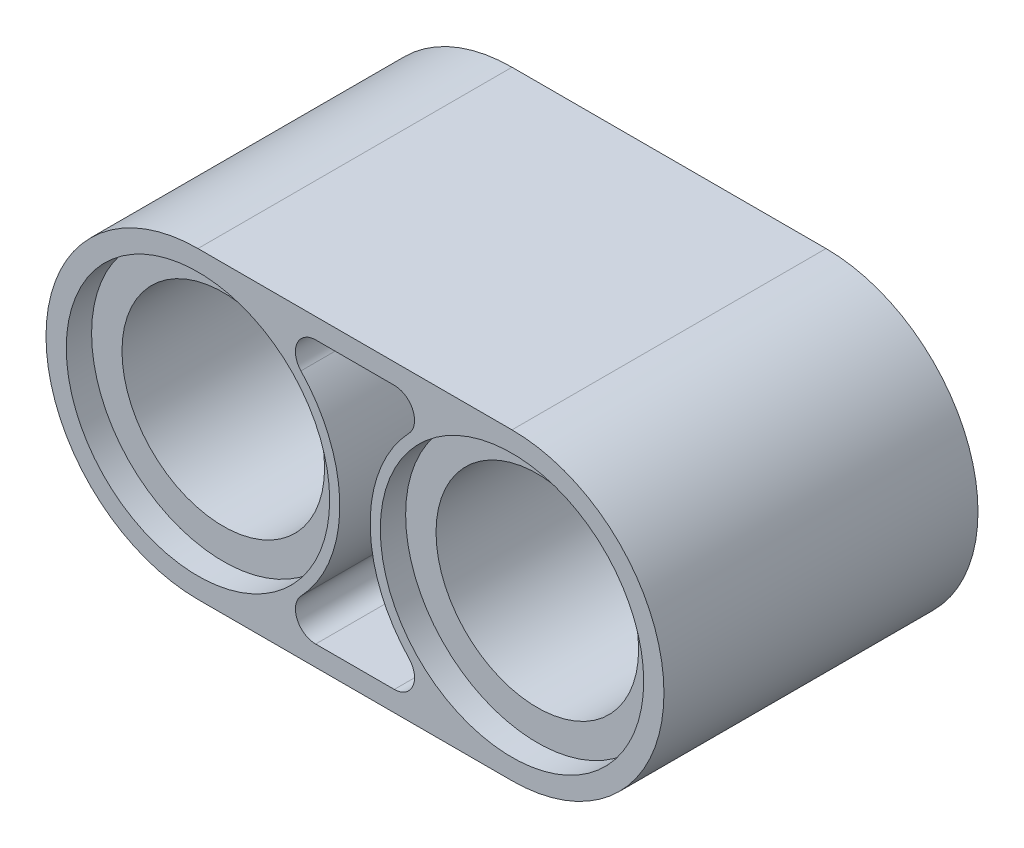
ISO-10303-21;
HEADER;
FILE_DESCRIPTION(('STEP AP214'),'2;1');
FILE_NAME('part.step','',(''),(''),'','','');
FILE_SCHEMA(('AUTOMOTIVE_DESIGN { 1 0 10303 214 1 1 1 1 }'));
ENDSEC;
DATA;
#1=APPLICATION_CONTEXT('core data for automotive mechanical design processes');
#2=APPLICATION_PROTOCOL_DEFINITION('international standard','automotive_design',2000,#1);
#3=PRODUCT_CONTEXT('',#1,'mechanical');
#4=PRODUCT('Part','Part','',(#3));
#5=PRODUCT_RELATED_PRODUCT_CATEGORY('part','',(#4));
#6=PRODUCT_DEFINITION_FORMATION('','',#4);
#7=PRODUCT_DEFINITION_CONTEXT('part definition',#1,'design');
#8=PRODUCT_DEFINITION('design','',#6,#7);
#9=PRODUCT_DEFINITION_SHAPE('','',#8);
#10=(LENGTH_UNIT() NAMED_UNIT(*) SI_UNIT(.MILLI.,.METRE.));
#11=(NAMED_UNIT(*) PLANE_ANGLE_UNIT() SI_UNIT($,.RADIAN.));
#12=(NAMED_UNIT(*) SI_UNIT($,.STERADIAN.) SOLID_ANGLE_UNIT());
#13=UNCERTAINTY_MEASURE_WITH_UNIT(LENGTH_MEASURE(1.E-05),#10,'distance_accuracy_value','');
#14=(GEOMETRIC_REPRESENTATION_CONTEXT(3) GLOBAL_UNCERTAINTY_ASSIGNED_CONTEXT((#13)) GLOBAL_UNIT_ASSIGNED_CONTEXT((#10,
#11,#12)) REPRESENTATION_CONTEXT('',''));
#15=CARTESIAN_POINT('',(0.,0.,0.));
#16=DIRECTION('',(0.,0.,1.));
#17=DIRECTION('',(1.,0.,0.));
#18=AXIS2_PLACEMENT_3D('',#15,#16,#17);
#19=CARTESIAN_POINT('',(0.,-22.684563487398,0.));
#20=DIRECTION('',(0.,0.,1.));
#21=DIRECTION('',(1.,0.,0.));
#22=AXIS2_PLACEMENT_3D('',#19,#20,#21);
#23=PLANE('',#22);
#24=DIRECTION('',(-1.,0.,0.));
#25=VECTOR('',#24,1.);
#26=CARTESIAN_POINT('',(0.,-3.81,0.));
#27=LINE('',#26,#25);
#28=CARTESIAN_POINT('',(7.874,-3.81,0.));
#29=VERTEX_POINT('',#28);
#30=CARTESIAN_POINT('',(0.,-3.81000000000003,0.));
#31=VERTEX_POINT('',#30);
#32=EDGE_CURVE('E214',#29,#31,#27,.T.);
#33=ORIENTED_EDGE('',*,*,#32,.T.);
#34=CARTESIAN_POINT('',(0.,0.,0.));
#35=DIRECTION('',(0.,0.,1.));
#36=DIRECTION('',(1.,0.,0.));
#37=AXIS2_PLACEMENT_3D('',#34,#35,#36);
#38=CIRCLE('',#37,3.81);
#39=CARTESIAN_POINT('',(0.,3.80999999999997,0.));
#40=VERTEX_POINT('',#39);
#41=EDGE_CURVE('E132',#31,#40,#38,.F.);
#42=ORIENTED_EDGE('',*,*,#41,.T.);
#43=DIRECTION('',(-1.,0.,0.));
#44=VECTOR('',#43,1.);
#45=CARTESIAN_POINT('',(0.,3.81,0.));
#46=LINE('',#45,#44);
#47=CARTESIAN_POINT('',(7.874,3.81,0.));
#48=VERTEX_POINT('',#47);
#49=EDGE_CURVE('E217',#48,#40,#46,.T.);
#50=ORIENTED_EDGE('',*,*,#49,.F.);
#51=CARTESIAN_POINT('',(7.874,0.,0.));
#52=DIRECTION('',(0.,0.,1.));
#53=DIRECTION('',(1.,0.,0.));
#54=AXIS2_PLACEMENT_3D('',#51,#52,#53);
#55=CIRCLE('',#54,3.81);
#56=EDGE_CURVE('E52',#29,#48,#55,.T.);
#57=ORIENTED_EDGE('',*,*,#56,.F.);
#58=EDGE_LOOP('',(#33,#42,#50,#57));
#59=FACE_BOUND('',#58,.T.);
#60=DIRECTION('',(1.,0.,0.));
#61=VECTOR('',#60,1.);
#62=CARTESIAN_POINT('',(0.,3.30200000000001,0.));
#63=LINE('',#62,#61);
#64=CARTESIAN_POINT('',(2.95121330981004,3.30199999999997,0.));
#65=VERTEX_POINT('',#64);
#66=CARTESIAN_POINT('',(4.92278669018995,3.302,0.));
#67=VERTEX_POINT('',#66);
#68=EDGE_CURVE('E201',#65,#67,#63,.T.);
#69=ORIENTED_EDGE('',*,*,#68,.F.);
#70=CARTESIAN_POINT('',(2.95121330981004,2.79399999999997,0.));
#71=DIRECTION('',(0.,0.,1.));
#72=DIRECTION('',(1.,0.,0.));
#73=AXIS2_PLACEMENT_3D('',#70,#71,#72);
#74=CIRCLE('',#73,0.508);
#75=CARTESIAN_POINT('',(2.58231164608378,2.44474999999997,0.));
#76=VERTEX_POINT('',#75);
#77=EDGE_CURVE('E180',#65,#76,#74,.T.);
#78=ORIENTED_EDGE('',*,*,#77,.T.);
#79=CARTESIAN_POINT('',(0.,0.,0.));
#80=DIRECTION('',(0.,0.,1.));
#81=DIRECTION('',(1.,0.,0.));
#82=AXIS2_PLACEMENT_3D('',#79,#80,#81);
#83=CIRCLE('',#82,3.556);
#84=CARTESIAN_POINT('',(2.58231164608378,-2.44475000000003,0.));
#85=VERTEX_POINT('',#84);
#86=EDGE_CURVE('E177',#76,#85,#83,.F.);
#87=ORIENTED_EDGE('',*,*,#86,.T.);
#88=CARTESIAN_POINT('',(2.95121330981004,-2.79400000000003,0.));
#89=DIRECTION('',(0.,0.,1.));
#90=DIRECTION('',(1.,0.,0.));
#91=AXIS2_PLACEMENT_3D('',#88,#89,#90);
#92=CIRCLE('',#91,0.508);
#93=CARTESIAN_POINT('',(2.95121330981004,-3.30200000000003,0.));
#94=VERTEX_POINT('',#93);
#95=EDGE_CURVE('E174',#85,#94,#92,.T.);
#96=ORIENTED_EDGE('',*,*,#95,.T.);
#97=DIRECTION('',(1.,0.,0.));
#98=VECTOR('',#97,1.);
#99=CARTESIAN_POINT('',(0.,-3.30200000000001,0.));
#100=LINE('',#99,#98);
#101=CARTESIAN_POINT('',(4.92278669018995,-3.302,0.));
#102=VERTEX_POINT('',#101);
#103=EDGE_CURVE('E211',#94,#102,#100,.T.);
#104=ORIENTED_EDGE('',*,*,#103,.T.);
#105=CARTESIAN_POINT('',(4.92278669018995,-2.794,0.));
#106=DIRECTION('',(0.,0.,1.));
#107=DIRECTION('',(1.,0.,0.));
#108=AXIS2_PLACEMENT_3D('',#105,#106,#107);
#109=CIRCLE('',#108,0.508);
#110=CARTESIAN_POINT('',(5.29168835391621,-2.44475,0.));
#111=VERTEX_POINT('',#110);
#112=EDGE_CURVE('E208',#111,#102,#109,.F.);
#113=ORIENTED_EDGE('',*,*,#112,.F.);
#114=CARTESIAN_POINT('',(7.874,0.,0.));
#115=DIRECTION('',(0.,0.,1.));
#116=DIRECTION('',(1.,0.,0.));
#117=AXIS2_PLACEMENT_3D('',#114,#115,#116);
#118=CIRCLE('',#117,3.556);
#119=CARTESIAN_POINT('',(5.2916883539162,2.44475,0.));
#120=VERTEX_POINT('',#119);
#121=EDGE_CURVE('E206',#120,#111,#118,.T.);
#122=ORIENTED_EDGE('',*,*,#121,.F.);
#123=CARTESIAN_POINT('',(4.92278669018995,2.794,0.));
#124=DIRECTION('',(0.,0.,1.));
#125=DIRECTION('',(1.,0.,0.));
#126=AXIS2_PLACEMENT_3D('',#123,#124,#125);
#127=CIRCLE('',#126,0.508);
#128=EDGE_CURVE('E204',#67,#120,#127,.F.);
#129=ORIENTED_EDGE('',*,*,#128,.F.);
#130=EDGE_LOOP('',(#69,#78,#87,#96,#104,#113,#122,#129));
#131=FACE_BOUND('',#130,.T.);
#132=CARTESIAN_POINT('',(7.874,0.,0.));
#133=DIRECTION('',(0.,0.,1.));
#134=DIRECTION('',(1.,0.,0.));
#135=AXIS2_PLACEMENT_3D('',#132,#133,#134);
#136=CIRCLE('',#135,3.302);
#137=CARTESIAN_POINT('',(11.176,0.,0.));
#138=VERTEX_POINT('',#137);
#139=EDGE_CURVE('E136',#138,#138,#136,.T.);
#140=ORIENTED_EDGE('',*,*,#139,.T.);
#141=EDGE_LOOP('',(#140));
#142=FACE_BOUND('',#141,.T.);
#143=CARTESIAN_POINT('',(0.,0.,0.));
#144=DIRECTION('',(0.,0.,1.));
#145=DIRECTION('',(1.,0.,0.));
#146=AXIS2_PLACEMENT_3D('',#143,#144,#145);
#147=CIRCLE('',#146,3.302);
#148=CARTESIAN_POINT('',(3.302,0.,0.));
#149=VERTEX_POINT('',#148);
#150=EDGE_CURVE('E161',#149,#149,#147,.T.);
#151=ORIENTED_EDGE('',*,*,#150,.T.);
#152=EDGE_LOOP('',(#151));
#153=FACE_BOUND('',#152,.T.);
#154=ADVANCED_FACE('F36',(#59,#131,#142,#153),#23,.F.);
#155=CARTESIAN_POINT('',(0.,3.30200000000001,3.937));
#156=DIRECTION('',(0.,1.,0.));
#157=DIRECTION('',(-1.,0.,0.));
#158=AXIS2_PLACEMENT_3D('',#155,#156,#157);
#159=PLANE('',#158);
#160=ORIENTED_EDGE('',*,*,#68,.T.);
#161=DIRECTION('',(0.,0.,-1.));
#162=VECTOR('',#161,1.);
#163=CARTESIAN_POINT('',(4.92278669018995,3.302,3.937));
#164=LINE('',#163,#162);
#165=CARTESIAN_POINT('',(4.92278669018995,3.302,7.874));
#166=VERTEX_POINT('',#165);
#167=EDGE_CURVE('E11',#166,#67,#164,.T.);
#168=ORIENTED_EDGE('',*,*,#167,.F.);
#169=DIRECTION('',(1.,0.,0.));
#170=VECTOR('',#169,1.);
#171=CARTESIAN_POINT('',(0.,3.30200000000001,7.874));
#172=LINE('',#171,#170);
#173=CARTESIAN_POINT('',(2.95121330981004,3.30199999999997,7.874));
#174=VERTEX_POINT('',#173);
#175=EDGE_CURVE('E165',#174,#166,#172,.T.);
#176=ORIENTED_EDGE('',*,*,#175,.F.);
#177=DIRECTION('',(0.,0.,-1.));
#178=VECTOR('',#177,1.);
#179=CARTESIAN_POINT('',(2.95121330981004,3.30199999999997,3.937));
#180=LINE('',#179,#178);
#181=EDGE_CURVE('E185',#174,#65,#180,.T.);
#182=ORIENTED_EDGE('',*,*,#181,.T.);
#183=EDGE_LOOP('',(#160,#168,#176,#182));
#184=FACE_BOUND('',#183,.T.);
#185=ADVANCED_FACE('F299',(#184),#159,.F.);
#186=CARTESIAN_POINT('',(4.92278669018995,2.794,3.937));
#187=DIRECTION('',(0.,0.,-1.));
#188=DIRECTION('',(-1.,0.,0.));
#189=AXIS2_PLACEMENT_3D('',#186,#187,#188);
#190=CYLINDRICAL_SURFACE('',#189,0.508);
#191=ORIENTED_EDGE('',*,*,#128,.T.);
#192=DIRECTION('',(0.,0.,-1.));
#193=VECTOR('',#192,1.);
#194=CARTESIAN_POINT('',(5.2916883539162,2.44475,3.937));
#195=LINE('',#194,#193);
#196=CARTESIAN_POINT('',(5.2916883539162,2.44475,7.874));
#197=VERTEX_POINT('',#196);
#198=EDGE_CURVE('E45',#197,#120,#195,.T.);
#199=ORIENTED_EDGE('',*,*,#198,.F.);
#200=CARTESIAN_POINT('',(4.92278669018995,2.794,7.874));
#201=DIRECTION('',(0.,0.,1.));
#202=DIRECTION('',(1.,0.,0.));
#203=AXIS2_PLACEMENT_3D('',#200,#201,#202);
#204=CIRCLE('',#203,0.508);
#205=EDGE_CURVE('E247',#166,#197,#204,.F.);
#206=ORIENTED_EDGE('',*,*,#205,.F.);
#207=ORIENTED_EDGE('',*,*,#167,.T.);
#208=EDGE_LOOP('',(#191,#199,#206,#207));
#209=FACE_BOUND('',#208,.T.);
#210=ADVANCED_FACE('F305',(#209),#190,.F.);
#211=CARTESIAN_POINT('',(7.874,0.,3.937));
#212=DIRECTION('',(0.,0.,-1.));
#213=DIRECTION('',(-1.,0.,0.));
#214=AXIS2_PLACEMENT_3D('',#211,#212,#213);
#215=CYLINDRICAL_SURFACE('',#214,3.556);
#216=ORIENTED_EDGE('',*,*,#121,.T.);
#217=DIRECTION('',(0.,0.,-1.));
#218=VECTOR('',#217,1.);
#219=CARTESIAN_POINT('',(5.29168835391621,-2.44475,3.937));
#220=LINE('',#219,#218);
#221=CARTESIAN_POINT('',(5.29168835391621,-2.44475,7.874));
#222=VERTEX_POINT('',#221);
#223=EDGE_CURVE('E224',#222,#111,#220,.T.);
#224=ORIENTED_EDGE('',*,*,#223,.F.);
#225=CARTESIAN_POINT('',(7.874,0.,7.874));
#226=DIRECTION('',(0.,0.,1.));
#227=DIRECTION('',(1.,0.,0.));
#228=AXIS2_PLACEMENT_3D('',#225,#226,#227);
#229=CIRCLE('',#228,3.556);
#230=EDGE_CURVE('E233',#197,#222,#229,.T.);
#231=ORIENTED_EDGE('',*,*,#230,.F.);
#232=ORIENTED_EDGE('',*,*,#198,.T.);
#233=EDGE_LOOP('',(#216,#224,#231,#232));
#234=FACE_BOUND('',#233,.T.);
#235=ADVANCED_FACE('F231',(#234),#215,.T.);
#236=CARTESIAN_POINT('',(4.92278669018995,-2.794,3.937));
#237=DIRECTION('',(0.,0.,-1.));
#238=DIRECTION('',(-1.,0.,0.));
#239=AXIS2_PLACEMENT_3D('',#236,#237,#238);
#240=CYLINDRICAL_SURFACE('',#239,0.508);
#241=ORIENTED_EDGE('',*,*,#112,.T.);
#242=DIRECTION('',(0.,0.,-1.));
#243=VECTOR('',#242,1.);
#244=CARTESIAN_POINT('',(4.92278669018995,-3.302,3.937));
#245=LINE('',#244,#243);
#246=CARTESIAN_POINT('',(4.92278669018995,-3.302,7.874));
#247=VERTEX_POINT('',#246);
#248=EDGE_CURVE('E222',#247,#102,#245,.T.);
#249=ORIENTED_EDGE('',*,*,#248,.F.);
#250=CARTESIAN_POINT('',(4.92278669018995,-2.794,7.874));
#251=DIRECTION('',(0.,0.,1.));
#252=DIRECTION('',(1.,0.,0.));
#253=AXIS2_PLACEMENT_3D('',#250,#251,#252);
#254=CIRCLE('',#253,0.508);
#255=EDGE_CURVE('E156',#222,#247,#254,.F.);
#256=ORIENTED_EDGE('',*,*,#255,.F.);
#257=ORIENTED_EDGE('',*,*,#223,.T.);
#258=EDGE_LOOP('',(#241,#249,#256,#257));
#259=FACE_BOUND('',#258,.T.);
#260=ADVANCED_FACE('F241',(#259),#240,.F.);
#261=CARTESIAN_POINT('',(0.,-3.30200000000001,3.937));
#262=DIRECTION('',(0.,1.,0.));
#263=DIRECTION('',(-1.,0.,0.));
#264=AXIS2_PLACEMENT_3D('',#261,#262,#263);
#265=PLANE('',#264);
#266=ORIENTED_EDGE('',*,*,#103,.F.);
#267=DIRECTION('',(0.,0.,-1.));
#268=VECTOR('',#267,1.);
#269=CARTESIAN_POINT('',(2.95121330981004,-3.30200000000003,3.937));
#270=LINE('',#269,#268);
#271=CARTESIAN_POINT('',(2.95121330981004,-3.30200000000003,7.874));
#272=VERTEX_POINT('',#271);
#273=EDGE_CURVE('E137',#272,#94,#270,.T.);
#274=ORIENTED_EDGE('',*,*,#273,.F.);
#275=DIRECTION('',(1.,0.,0.));
#276=VECTOR('',#275,1.);
#277=CARTESIAN_POINT('',(0.,-3.30200000000001,7.874));
#278=LINE('',#277,#276);
#279=EDGE_CURVE('E152',#272,#247,#278,.T.);
#280=ORIENTED_EDGE('',*,*,#279,.T.);
#281=ORIENTED_EDGE('',*,*,#248,.T.);
#282=EDGE_LOOP('',(#266,#274,#280,#281));
#283=FACE_BOUND('',#282,.T.);
#284=ADVANCED_FACE('F320',(#283),#265,.T.);
#285=CARTESIAN_POINT('',(0.,-3.81,3.937));
#286=DIRECTION('',(0.,-1.,0.));
#287=DIRECTION('',(1.,0.,0.));
#288=AXIS2_PLACEMENT_3D('',#285,#286,#287);
#289=PLANE('',#288);
#290=ORIENTED_EDGE('',*,*,#32,.F.);
#291=DIRECTION('',(0.,0.,-1.));
#292=VECTOR('',#291,1.);
#293=CARTESIAN_POINT('',(7.874,-3.81,3.937));
#294=LINE('',#293,#292);
#295=CARTESIAN_POINT('',(7.874,-3.81,7.874));
#296=VERTEX_POINT('',#295);
#297=EDGE_CURVE('E57',#296,#29,#294,.T.);
#298=ORIENTED_EDGE('',*,*,#297,.F.);
#299=DIRECTION('',(-1.,0.,0.));
#300=VECTOR('',#299,1.);
#301=CARTESIAN_POINT('',(0.,-3.81,7.874));
#302=LINE('',#301,#300);
#303=CARTESIAN_POINT('',(0.,-3.81000000000003,7.874));
#304=VERTEX_POINT('',#303);
#305=EDGE_CURVE('E144',#296,#304,#302,.T.);
#306=ORIENTED_EDGE('',*,*,#305,.T.);
#307=DIRECTION('',(0.,0.,-1.));
#308=VECTOR('',#307,1.);
#309=CARTESIAN_POINT('',(0.,-3.81000000000003,3.937));
#310=LINE('',#309,#308);
#311=EDGE_CURVE('E125',#304,#31,#310,.T.);
#312=ORIENTED_EDGE('',*,*,#311,.T.);
#313=EDGE_LOOP('',(#290,#298,#306,#312));
#314=FACE_BOUND('',#313,.T.);
#315=ADVANCED_FACE('F150',(#314),#289,.T.);
#316=CARTESIAN_POINT('',(7.874,0.,3.937));
#317=DIRECTION('',(0.,0.,-1.));
#318=DIRECTION('',(-1.,0.,0.));
#319=AXIS2_PLACEMENT_3D('',#316,#317,#318);
#320=CYLINDRICAL_SURFACE('',#319,3.81);
#321=ORIENTED_EDGE('',*,*,#56,.T.);
#322=DIRECTION('',(0.,0.,-1.));
#323=VECTOR('',#322,1.);
#324=CARTESIAN_POINT('',(7.874,3.81,3.937));
#325=LINE('',#324,#323);
#326=CARTESIAN_POINT('',(7.874,3.81,7.874));
#327=VERTEX_POINT('',#326);
#328=EDGE_CURVE('E219',#327,#48,#325,.T.);
#329=ORIENTED_EDGE('',*,*,#328,.F.);
#330=CARTESIAN_POINT('',(7.874,0.,7.874));
#331=DIRECTION('',(0.,0.,1.));
#332=DIRECTION('',(1.,0.,0.));
#333=AXIS2_PLACEMENT_3D('',#330,#331,#332);
#334=CIRCLE('',#333,3.81);
#335=EDGE_CURVE('E151',#296,#327,#334,.T.);
#336=ORIENTED_EDGE('',*,*,#335,.F.);
#337=ORIENTED_EDGE('',*,*,#297,.T.);
#338=EDGE_LOOP('',(#321,#329,#336,#337));
#339=FACE_BOUND('',#338,.T.);
#340=ADVANCED_FACE('F314',(#339),#320,.T.);
#341=CARTESIAN_POINT('',(0.,3.81,3.937));
#342=DIRECTION('',(0.,-1.,0.));
#343=DIRECTION('',(1.,0.,0.));
#344=AXIS2_PLACEMENT_3D('',#341,#342,#343);
#345=PLANE('',#344);
#346=ORIENTED_EDGE('',*,*,#49,.T.);
#347=DIRECTION('',(0.,0.,-1.));
#348=VECTOR('',#347,1.);
#349=CARTESIAN_POINT('',(0.,3.80999999999997,3.937));
#350=LINE('',#349,#348);
#351=CARTESIAN_POINT('',(0.,3.80999999999997,7.874));
#352=VERTEX_POINT('',#351);
#353=EDGE_CURVE('E183',#352,#40,#350,.T.);
#354=ORIENTED_EDGE('',*,*,#353,.F.);
#355=DIRECTION('',(-1.,0.,0.));
#356=VECTOR('',#355,1.);
#357=CARTESIAN_POINT('',(0.,3.81,7.874));
#358=LINE('',#357,#356);
#359=EDGE_CURVE('E146',#327,#352,#358,.T.);
#360=ORIENTED_EDGE('',*,*,#359,.F.);
#361=ORIENTED_EDGE('',*,*,#328,.T.);
#362=EDGE_LOOP('',(#346,#354,#360,#361));
#363=FACE_BOUND('',#362,.T.);
#364=ADVANCED_FACE('F311',(#363),#345,.F.);
#365=CARTESIAN_POINT('',(7.874,0.,3.937));
#366=DIRECTION('',(0.,0.,-1.));
#367=DIRECTION('',(-1.,0.,0.));
#368=AXIS2_PLACEMENT_3D('',#365,#366,#367);
#369=CYLINDRICAL_SURFACE('',#368,2.54);
#370=CARTESIAN_POINT('',(7.874,0.,0.635));
#371=DIRECTION('',(0.,0.,1.));
#372=DIRECTION('',(1.,0.,0.));
#373=AXIS2_PLACEMENT_3D('',#370,#371,#372);
#374=CIRCLE('',#373,2.54);
#375=CARTESIAN_POINT('',(10.414,0.,0.635));
#376=VERTEX_POINT('',#375);
#377=EDGE_CURVE('E40',#376,#376,#374,.T.);
#378=ORIENTED_EDGE('',*,*,#377,.F.);
#379=EDGE_LOOP('',(#378));
#380=FACE_BOUND('',#379,.T.);
#381=CARTESIAN_POINT('',(7.874,0.,7.239));
#382=DIRECTION('',(0.,0.,1.));
#383=DIRECTION('',(1.,0.,0.));
#384=AXIS2_PLACEMENT_3D('',#381,#382,#383);
#385=CIRCLE('',#384,2.54);
#386=CARTESIAN_POINT('',(10.414,0.,7.239));
#387=VERTEX_POINT('',#386);
#388=EDGE_CURVE('E162',#387,#387,#385,.T.);
#389=ORIENTED_EDGE('',*,*,#388,.T.);
#390=EDGE_LOOP('',(#389));
#391=FACE_BOUND('',#390,.T.);
#392=ADVANCED_FACE('F38',(#380,#391),#369,.F.);
#393=CARTESIAN_POINT('',(7.874,0.,0.635));
#394=DIRECTION('',(0.,0.,-1.));
#395=DIRECTION('',(-1.,0.,0.));
#396=AXIS2_PLACEMENT_3D('',#393,#394,#395);
#397=CYLINDRICAL_SURFACE('',#396,3.302);
#398=CARTESIAN_POINT('',(7.874,0.,0.635));
#399=DIRECTION('',(0.,0.,1.));
#400=DIRECTION('',(1.,0.,0.));
#401=AXIS2_PLACEMENT_3D('',#398,#399,#400);
#402=CIRCLE('',#401,3.302);
#403=CARTESIAN_POINT('',(11.176,0.,0.635));
#404=VERTEX_POINT('',#403);
#405=EDGE_CURVE('E196',#404,#404,#402,.T.);
#406=ORIENTED_EDGE('',*,*,#405,.T.);
#407=EDGE_LOOP('',(#406));
#408=FACE_BOUND('',#407,.T.);
#409=ORIENTED_EDGE('',*,*,#139,.F.);
#410=EDGE_LOOP('',(#409));
#411=FACE_BOUND('',#410,.T.);
#412=ADVANCED_FACE('F309',(#408,#411),#397,.F.);
#413=CARTESIAN_POINT('',(7.874,0.,0.635));
#414=DIRECTION('',(0.,0.,1.));
#415=DIRECTION('',(1.,0.,0.));
#416=AXIS2_PLACEMENT_3D('',#413,#414,#415);
#417=PLANE('',#416);
#418=ORIENTED_EDGE('',*,*,#377,.T.);
#419=EDGE_LOOP('',(#418));
#420=FACE_BOUND('',#419,.T.);
#421=ORIENTED_EDGE('',*,*,#405,.F.);
#422=EDGE_LOOP('',(#421));
#423=FACE_BOUND('',#422,.T.);
#424=ADVANCED_FACE('F351',(#420,#423),#417,.F.);
#425=CARTESIAN_POINT('',(0.,0.,3.937));
#426=DIRECTION('',(0.,0.,-1.));
#427=DIRECTION('',(-1.,0.,0.));
#428=AXIS2_PLACEMENT_3D('',#425,#426,#427);
#429=CYLINDRICAL_SURFACE('',#428,3.81);
#430=ORIENTED_EDGE('',*,*,#41,.F.);
#431=ORIENTED_EDGE('',*,*,#311,.F.);
#432=CARTESIAN_POINT('',(0.,0.,7.874));
#433=DIRECTION('',(0.,0.,1.));
#434=DIRECTION('',(1.,0.,0.));
#435=AXIS2_PLACEMENT_3D('',#432,#433,#434);
#436=CIRCLE('',#435,3.81);
#437=EDGE_CURVE('E129',#304,#352,#436,.F.);
#438=ORIENTED_EDGE('',*,*,#437,.T.);
#439=ORIENTED_EDGE('',*,*,#353,.T.);
#440=EDGE_LOOP('',(#430,#431,#438,#439));
#441=FACE_BOUND('',#440,.T.);
#442=ADVANCED_FACE('F127',(#441),#429,.T.);
#443=CARTESIAN_POINT('',(2.95121330981004,-2.79400000000003,3.937));
#444=DIRECTION('',(0.,0.,-1.));
#445=DIRECTION('',(-1.,0.,0.));
#446=AXIS2_PLACEMENT_3D('',#443,#444,#445);
#447=CYLINDRICAL_SURFACE('',#446,0.508);
#448=ORIENTED_EDGE('',*,*,#95,.F.);
#449=DIRECTION('',(0.,0.,-1.));
#450=VECTOR('',#449,1.);
#451=CARTESIAN_POINT('',(2.58231164608378,-2.44475000000003,3.937));
#452=LINE('',#451,#450);
#453=CARTESIAN_POINT('',(2.58231164608378,-2.44475000000003,7.874));
#454=VERTEX_POINT('',#453);
#455=EDGE_CURVE('E190',#454,#85,#452,.T.);
#456=ORIENTED_EDGE('',*,*,#455,.F.);
#457=CARTESIAN_POINT('',(2.95121330981004,-2.79400000000003,7.874));
#458=DIRECTION('',(0.,0.,1.));
#459=DIRECTION('',(1.,0.,0.));
#460=AXIS2_PLACEMENT_3D('',#457,#458,#459);
#461=CIRCLE('',#460,0.508);
#462=EDGE_CURVE('E147',#454,#272,#461,.T.);
#463=ORIENTED_EDGE('',*,*,#462,.T.);
#464=ORIENTED_EDGE('',*,*,#273,.T.);
#465=EDGE_LOOP('',(#448,#456,#463,#464));
#466=FACE_BOUND('',#465,.T.);
#467=ADVANCED_FACE('F343',(#466),#447,.F.);
#468=CARTESIAN_POINT('',(0.,0.,3.937));
#469=DIRECTION('',(0.,0.,-1.));
#470=DIRECTION('',(-1.,0.,0.));
#471=AXIS2_PLACEMENT_3D('',#468,#469,#470);
#472=CYLINDRICAL_SURFACE('',#471,3.556);
#473=ORIENTED_EDGE('',*,*,#86,.F.);
#474=DIRECTION('',(0.,0.,-1.));
#475=VECTOR('',#474,1.);
#476=CARTESIAN_POINT('',(2.58231164608378,2.44474999999997,3.937));
#477=LINE('',#476,#475);
#478=CARTESIAN_POINT('',(2.58231164608378,2.44474999999997,7.874));
#479=VERTEX_POINT('',#478);
#480=EDGE_CURVE('E188',#479,#76,#477,.T.);
#481=ORIENTED_EDGE('',*,*,#480,.F.);
#482=CARTESIAN_POINT('',(0.,0.,7.874));
#483=DIRECTION('',(0.,0.,1.));
#484=DIRECTION('',(1.,0.,0.));
#485=AXIS2_PLACEMENT_3D('',#482,#483,#484);
#486=CIRCLE('',#485,3.556);
#487=EDGE_CURVE('E263',#479,#454,#486,.F.);
#488=ORIENTED_EDGE('',*,*,#487,.T.);
#489=ORIENTED_EDGE('',*,*,#455,.T.);
#490=EDGE_LOOP('',(#473,#481,#488,#489));
#491=FACE_BOUND('',#490,.T.);
#492=ADVANCED_FACE('F339',(#491),#472,.T.);
#493=CARTESIAN_POINT('',(2.95121330981004,2.79399999999997,3.937));
#494=DIRECTION('',(0.,0.,-1.));
#495=DIRECTION('',(-1.,0.,0.));
#496=AXIS2_PLACEMENT_3D('',#493,#494,#495);
#497=CYLINDRICAL_SURFACE('',#496,0.508);
#498=ORIENTED_EDGE('',*,*,#77,.F.);
#499=ORIENTED_EDGE('',*,*,#181,.F.);
#500=CARTESIAN_POINT('',(2.95121330981004,2.79399999999997,7.874));
#501=DIRECTION('',(0.,0.,1.));
#502=DIRECTION('',(1.,0.,0.));
#503=AXIS2_PLACEMENT_3D('',#500,#501,#502);
#504=CIRCLE('',#503,0.508);
#505=EDGE_CURVE('E255',#174,#479,#504,.T.);
#506=ORIENTED_EDGE('',*,*,#505,.T.);
#507=ORIENTED_EDGE('',*,*,#480,.T.);
#508=EDGE_LOOP('',(#498,#499,#506,#507));
#509=FACE_BOUND('',#508,.T.);
#510=ADVANCED_FACE('F335',(#509),#497,.F.);
#511=CARTESIAN_POINT('',(0.,0.,3.937));
#512=DIRECTION('',(0.,0.,-1.));
#513=DIRECTION('',(-1.,0.,0.));
#514=AXIS2_PLACEMENT_3D('',#511,#512,#513);
#515=CYLINDRICAL_SURFACE('',#514,2.54);
#516=CARTESIAN_POINT('',(0.,0.,0.635));
#517=DIRECTION('',(0.,0.,1.));
#518=DIRECTION('',(1.,0.,0.));
#519=AXIS2_PLACEMENT_3D('',#516,#517,#518);
#520=CIRCLE('',#519,2.54);
#521=CARTESIAN_POINT('',(2.53999999999999,0.,0.635));
#522=VERTEX_POINT('',#521);
#523=EDGE_CURVE('E170',#522,#522,#520,.F.);
#524=ORIENTED_EDGE('',*,*,#523,.T.);
#525=EDGE_LOOP('',(#524));
#526=FACE_BOUND('',#525,.T.);
#527=CARTESIAN_POINT('',(0.,0.,7.239));
#528=DIRECTION('',(0.,0.,1.));
#529=DIRECTION('',(1.,0.,0.));
#530=AXIS2_PLACEMENT_3D('',#527,#528,#529);
#531=CIRCLE('',#530,2.54);
#532=CARTESIAN_POINT('',(2.53999999999999,0.,7.239));
#533=VERTEX_POINT('',#532);
#534=EDGE_CURVE('E148',#533,#533,#531,.F.);
#535=ORIENTED_EDGE('',*,*,#534,.F.);
#536=EDGE_LOOP('',(#535));
#537=FACE_BOUND('',#536,.T.);
#538=ADVANCED_FACE('F355',(#526,#537),#515,.F.);
#539=CARTESIAN_POINT('',(0.,0.,0.635));
#540=DIRECTION('',(0.,0.,1.));
#541=DIRECTION('',(1.,0.,0.));
#542=AXIS2_PLACEMENT_3D('',#539,#540,#541);
#543=PLANE('',#542);
#544=CARTESIAN_POINT('',(0.,0.,0.635));
#545=DIRECTION('',(0.,0.,1.));
#546=DIRECTION('',(1.,0.,0.));
#547=AXIS2_PLACEMENT_3D('',#544,#545,#546);
#548=CIRCLE('',#547,3.302);
#549=CARTESIAN_POINT('',(3.302,0.,0.635));
#550=VERTEX_POINT('',#549);
#551=EDGE_CURVE('E167',#550,#550,#548,.T.);
#552=ORIENTED_EDGE('',*,*,#551,.F.);
#553=EDGE_LOOP('',(#552));
#554=FACE_BOUND('',#553,.T.);
#555=ORIENTED_EDGE('',*,*,#523,.F.);
#556=EDGE_LOOP('',(#555));
#557=FACE_BOUND('',#556,.T.);
#558=ADVANCED_FACE('F294',(#554,#557),#543,.F.);
#559=CARTESIAN_POINT('',(0.,0.,0.635));
#560=DIRECTION('',(0.,0.,-1.));
#561=DIRECTION('',(-1.,0.,0.));
#562=AXIS2_PLACEMENT_3D('',#559,#560,#561);
#563=CYLINDRICAL_SURFACE('',#562,3.302);
#564=ORIENTED_EDGE('',*,*,#551,.T.);
#565=EDGE_LOOP('',(#564));
#566=FACE_BOUND('',#565,.T.);
#567=ORIENTED_EDGE('',*,*,#150,.F.);
#568=EDGE_LOOP('',(#567));
#569=FACE_BOUND('',#568,.T.);
#570=ADVANCED_FACE('F285',(#566,#569),#563,.F.);
#571=CARTESIAN_POINT('',(0.,-22.684563487398,7.874));
#572=DIRECTION('',(0.,0.,-1.));
#573=DIRECTION('',(1.,0.,0.));
#574=AXIS2_PLACEMENT_3D('',#571,#572,#573);
#575=PLANE('',#574);
#576=ORIENTED_EDGE('',*,*,#305,.F.);
#577=ORIENTED_EDGE('',*,*,#335,.T.);
#578=ORIENTED_EDGE('',*,*,#359,.T.);
#579=ORIENTED_EDGE('',*,*,#437,.F.);
#580=EDGE_LOOP('',(#576,#577,#578,#579));
#581=FACE_BOUND('',#580,.T.);
#582=ORIENTED_EDGE('',*,*,#175,.T.);
#583=ORIENTED_EDGE('',*,*,#205,.T.);
#584=ORIENTED_EDGE('',*,*,#230,.T.);
#585=ORIENTED_EDGE('',*,*,#255,.T.);
#586=ORIENTED_EDGE('',*,*,#279,.F.);
#587=ORIENTED_EDGE('',*,*,#462,.F.);
#588=ORIENTED_EDGE('',*,*,#487,.F.);
#589=ORIENTED_EDGE('',*,*,#505,.F.);
#590=EDGE_LOOP('',(#582,#583,#584,#585,#586,#587,#588,#589));
#591=FACE_BOUND('',#590,.T.);
#592=CARTESIAN_POINT('',(7.874,0.,7.874));
#593=DIRECTION('',(0.,0.,1.));
#594=DIRECTION('',(1.,0.,0.));
#595=AXIS2_PLACEMENT_3D('',#592,#593,#594);
#596=CIRCLE('',#595,3.302);
#597=CARTESIAN_POINT('',(11.176,0.,7.874));
#598=VERTEX_POINT('',#597);
#599=EDGE_CURVE('E252',#598,#598,#596,.T.);
#600=ORIENTED_EDGE('',*,*,#599,.F.);
#601=EDGE_LOOP('',(#600));
#602=FACE_BOUND('',#601,.T.);
#603=CARTESIAN_POINT('',(0.,0.,7.874));
#604=DIRECTION('',(0.,0.,1.));
#605=DIRECTION('',(1.,0.,0.));
#606=AXIS2_PLACEMENT_3D('',#603,#604,#605);
#607=CIRCLE('',#606,3.302);
#608=CARTESIAN_POINT('',(3.302,0.,7.874));
#609=VERTEX_POINT('',#608);
#610=EDGE_CURVE('E268',#609,#609,#607,.T.);
#611=ORIENTED_EDGE('',*,*,#610,.F.);
#612=EDGE_LOOP('',(#611));
#613=FACE_BOUND('',#612,.T.);
#614=ADVANCED_FACE('F141',(#581,#591,#602,#613),#575,.F.);
#615=CARTESIAN_POINT('',(7.874,0.,7.239));
#616=DIRECTION('',(0.,0.,1.));
#617=DIRECTION('',(-1.,0.,0.));
#618=AXIS2_PLACEMENT_3D('',#615,#616,#617);
#619=CYLINDRICAL_SURFACE('',#618,3.302);
#620=CARTESIAN_POINT('',(7.874,0.,7.239));
#621=DIRECTION('',(0.,0.,1.));
#622=DIRECTION('',(1.,0.,0.));
#623=AXIS2_PLACEMENT_3D('',#620,#621,#622);
#624=CIRCLE('',#623,3.302);
#625=CARTESIAN_POINT('',(11.176,0.,7.239));
#626=VERTEX_POINT('',#625);
#627=EDGE_CURVE('E166',#626,#626,#624,.T.);
#628=ORIENTED_EDGE('',*,*,#627,.F.);
#629=EDGE_LOOP('',(#628));
#630=FACE_BOUND('',#629,.T.);
#631=ORIENTED_EDGE('',*,*,#599,.T.);
#632=EDGE_LOOP('',(#631));
#633=FACE_BOUND('',#632,.T.);
#634=ADVANCED_FACE('F284',(#630,#633),#619,.F.);
#635=CARTESIAN_POINT('',(7.874,0.,7.239));
#636=DIRECTION('',(0.,0.,-1.));
#637=DIRECTION('',(1.,0.,0.));
#638=AXIS2_PLACEMENT_3D('',#635,#636,#637);
#639=PLANE('',#638);
#640=ORIENTED_EDGE('',*,*,#388,.F.);
#641=EDGE_LOOP('',(#640));
#642=FACE_BOUND('',#641,.T.);
#643=ORIENTED_EDGE('',*,*,#627,.T.);
#644=EDGE_LOOP('',(#643));
#645=FACE_BOUND('',#644,.T.);
#646=ADVANCED_FACE('F291',(#642,#645),#639,.F.);
#647=CARTESIAN_POINT('',(0.,0.,7.239));
#648=DIRECTION('',(0.,0.,-1.));
#649=DIRECTION('',(1.,0.,0.));
#650=AXIS2_PLACEMENT_3D('',#647,#648,#649);
#651=PLANE('',#650);
#652=CARTESIAN_POINT('',(0.,0.,7.239));
#653=DIRECTION('',(0.,0.,1.));
#654=DIRECTION('',(1.,0.,0.));
#655=AXIS2_PLACEMENT_3D('',#652,#653,#654);
#656=CIRCLE('',#655,3.302);
#657=CARTESIAN_POINT('',(3.302,0.,7.239));
#658=VERTEX_POINT('',#657);
#659=EDGE_CURVE('E260',#658,#658,#656,.T.);
#660=ORIENTED_EDGE('',*,*,#659,.T.);
#661=EDGE_LOOP('',(#660));
#662=FACE_BOUND('',#661,.T.);
#663=ORIENTED_EDGE('',*,*,#534,.T.);
#664=EDGE_LOOP('',(#663));
#665=FACE_BOUND('',#664,.T.);
#666=ADVANCED_FACE('F274',(#662,#665),#651,.F.);
#667=CARTESIAN_POINT('',(0.,0.,7.239));
#668=DIRECTION('',(0.,0.,1.));
#669=DIRECTION('',(-1.,0.,0.));
#670=AXIS2_PLACEMENT_3D('',#667,#668,#669);
#671=CYLINDRICAL_SURFACE('',#670,3.302);
#672=ORIENTED_EDGE('',*,*,#659,.F.);
#673=EDGE_LOOP('',(#672));
#674=FACE_BOUND('',#673,.T.);
#675=ORIENTED_EDGE('',*,*,#610,.T.);
#676=EDGE_LOOP('',(#675));
#677=FACE_BOUND('',#676,.T.);
#678=ADVANCED_FACE('F277',(#674,#677),#671,.F.);
#679=CLOSED_SHELL('',(#154,#185,#210,#235,#260,#284,#315,#340,#364,#392,#412,#424,#442,#467,
#492,#510,#538,#558,#570,#614,#634,#646,#666,#678));
#680=MANIFOLD_SOLID_BREP('B2',#679);
#681=ADVANCED_BREP_SHAPE_REPRESENTATION('',(#18,#680),#14);
#682=SHAPE_DEFINITION_REPRESENTATION(#9,#681);
ENDSEC;
END-ISO-10303-21;
